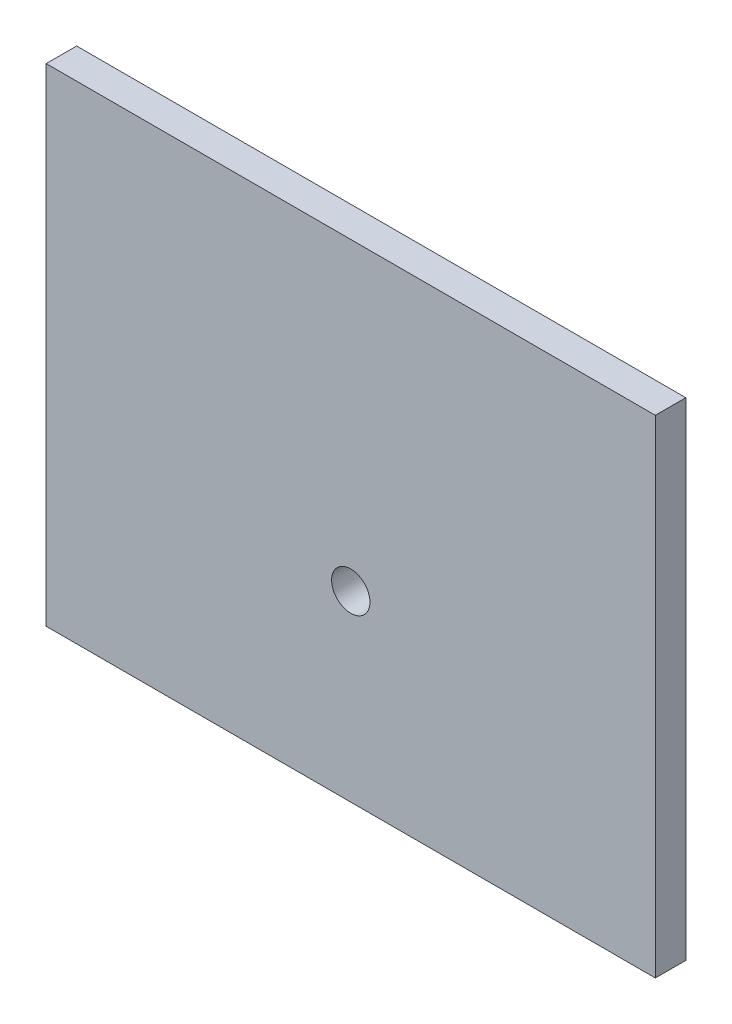
ISO-10303-21;
HEADER;
FILE_DESCRIPTION(('STEP AP214'),'2;1');
FILE_NAME('part.step','',(''),(''),'','','');
FILE_SCHEMA(('AUTOMOTIVE_DESIGN { 1 0 10303 214 1 1 1 1 }'));
ENDSEC;
DATA;
#1=APPLICATION_CONTEXT('core data for automotive mechanical design processes');
#2=APPLICATION_PROTOCOL_DEFINITION('international standard','automotive_design',2000,#1);
#3=PRODUCT_CONTEXT('',#1,'mechanical');
#4=PRODUCT('Part','Part','',(#3));
#5=PRODUCT_RELATED_PRODUCT_CATEGORY('part','',(#4));
#6=PRODUCT_DEFINITION_FORMATION('','',#4);
#7=PRODUCT_DEFINITION_CONTEXT('part definition',#1,'design');
#8=PRODUCT_DEFINITION('design','',#6,#7);
#9=PRODUCT_DEFINITION_SHAPE('','',#8);
#10=(LENGTH_UNIT() NAMED_UNIT(*) SI_UNIT(.MILLI.,.METRE.));
#11=(NAMED_UNIT(*) PLANE_ANGLE_UNIT() SI_UNIT($,.RADIAN.));
#12=(NAMED_UNIT(*) SI_UNIT($,.STERADIAN.) SOLID_ANGLE_UNIT());
#13=UNCERTAINTY_MEASURE_WITH_UNIT(LENGTH_MEASURE(1.E-05),#10,'distance_accuracy_value','');
#14=(GEOMETRIC_REPRESENTATION_CONTEXT(3) GLOBAL_UNCERTAINTY_ASSIGNED_CONTEXT((#13)) GLOBAL_UNIT_ASSIGNED_CONTEXT((#10,
#11,#12)) REPRESENTATION_CONTEXT('',''));
#15=CARTESIAN_POINT('',(0.,0.,0.));
#16=DIRECTION('',(0.,0.,1.));
#17=DIRECTION('',(1.,0.,0.));
#18=AXIS2_PLACEMENT_3D('',#15,#16,#17);
#19=CARTESIAN_POINT('',(0.,0.,6.35));
#20=DIRECTION('',(0.,0.,-1.));
#21=DIRECTION('',(-1.,0.,0.));
#22=AXIS2_PLACEMENT_3D('',#19,#20,#21);
#23=PLANE('',#22);
#24=DIRECTION('',(0.,-1.,0.));
#25=VECTOR('',#24,1.);
#26=CARTESIAN_POINT('',(0.,0.,6.35));
#27=LINE('',#26,#25);
#28=CARTESIAN_POINT('',(0.,101.6,6.35));
#29=VERTEX_POINT('',#28);
#30=CARTESIAN_POINT('',(0.,0.,6.35));
#31=VERTEX_POINT('',#30);
#32=EDGE_CURVE('E85',#29,#31,#27,.T.);
#33=ORIENTED_EDGE('',*,*,#32,.T.);
#34=DIRECTION('',(1.,0.,0.));
#35=VECTOR('',#34,1.);
#36=CARTESIAN_POINT('',(0.,0.,6.35));
#37=LINE('',#36,#35);
#38=CARTESIAN_POINT('',(127.,0.,6.35));
#39=VERTEX_POINT('',#38);
#40=EDGE_CURVE('E80',#31,#39,#37,.T.);
#41=ORIENTED_EDGE('',*,*,#40,.T.);
#42=DIRECTION('',(0.,1.,0.));
#43=VECTOR('',#42,1.);
#44=CARTESIAN_POINT('',(127.,0.,6.35));
#45=LINE('',#44,#43);
#46=CARTESIAN_POINT('',(127.,101.6,6.35));
#47=VERTEX_POINT('',#46);
#48=EDGE_CURVE('E83',#39,#47,#45,.T.);
#49=ORIENTED_EDGE('',*,*,#48,.T.);
#50=DIRECTION('',(-1.,0.,0.));
#51=VECTOR('',#50,1.);
#52=CARTESIAN_POINT('',(0.,101.6,6.35));
#53=LINE('',#52,#51);
#54=EDGE_CURVE('E50',#47,#29,#53,.T.);
#55=ORIENTED_EDGE('',*,*,#54,.T.);
#56=EDGE_LOOP('',(#33,#41,#49,#55));
#57=FACE_BOUND('',#56,.T.);
#58=CARTESIAN_POINT('',(63.5,38.1,6.35));
#59=DIRECTION('',(0.,0.,1.));
#60=DIRECTION('',(1.,0.,0.));
#61=AXIS2_PLACEMENT_3D('',#58,#59,#60);
#62=CIRCLE('',#61,4.00000000000002);
#63=CARTESIAN_POINT('',(67.5,38.1,6.35));
#64=VERTEX_POINT('',#63);
#65=EDGE_CURVE('E100',#64,#64,#62,.T.);
#66=ORIENTED_EDGE('',*,*,#65,.F.);
#67=EDGE_LOOP('',(#66));
#68=FACE_BOUND('',#67,.T.);
#69=ADVANCED_FACE('F33',(#57,#68),#23,.F.);
#70=CARTESIAN_POINT('',(0.,0.,0.));
#71=DIRECTION('',(0.,0.,-1.));
#72=DIRECTION('',(-1.,0.,0.));
#73=AXIS2_PLACEMENT_3D('',#70,#71,#72);
#74=PLANE('',#73);
#75=DIRECTION('',(0.,-1.,0.));
#76=VECTOR('',#75,1.);
#77=CARTESIAN_POINT('',(0.,0.,0.));
#78=LINE('',#77,#76);
#79=CARTESIAN_POINT('',(0.,101.6,0.));
#80=VERTEX_POINT('',#79);
#81=CARTESIAN_POINT('',(0.,0.,0.));
#82=VERTEX_POINT('',#81);
#83=EDGE_CURVE('E97',#80,#82,#78,.T.);
#84=ORIENTED_EDGE('',*,*,#83,.F.);
#85=DIRECTION('',(-1.,0.,0.));
#86=VECTOR('',#85,1.);
#87=CARTESIAN_POINT('',(0.,101.6,0.));
#88=LINE('',#87,#86);
#89=CARTESIAN_POINT('',(127.,101.6,0.));
#90=VERTEX_POINT('',#89);
#91=EDGE_CURVE('E73',#90,#80,#88,.T.);
#92=ORIENTED_EDGE('',*,*,#91,.F.);
#93=DIRECTION('',(0.,1.,0.));
#94=VECTOR('',#93,1.);
#95=CARTESIAN_POINT('',(127.,0.,0.));
#96=LINE('',#95,#94);
#97=CARTESIAN_POINT('',(127.,0.,0.));
#98=VERTEX_POINT('',#97);
#99=EDGE_CURVE('E67',#98,#90,#96,.T.);
#100=ORIENTED_EDGE('',*,*,#99,.F.);
#101=DIRECTION('',(1.,0.,0.));
#102=VECTOR('',#101,1.);
#103=CARTESIAN_POINT('',(0.,0.,0.));
#104=LINE('',#103,#102);
#105=EDGE_CURVE('E89',#82,#98,#104,.T.);
#106=ORIENTED_EDGE('',*,*,#105,.F.);
#107=EDGE_LOOP('',(#84,#92,#100,#106));
#108=FACE_BOUND('',#107,.T.);
#109=CARTESIAN_POINT('',(63.5,38.1,0.));
#110=DIRECTION('',(0.,0.,1.));
#111=DIRECTION('',(1.,0.,0.));
#112=AXIS2_PLACEMENT_3D('',#109,#110,#111);
#113=CIRCLE('',#112,4.00000000000002);
#114=CARTESIAN_POINT('',(67.5,38.1,0.));
#115=VERTEX_POINT('',#114);
#116=EDGE_CURVE('E112',#115,#115,#113,.T.);
#117=ORIENTED_EDGE('',*,*,#116,.T.);
#118=EDGE_LOOP('',(#117));
#119=FACE_BOUND('',#118,.T.);
#120=ADVANCED_FACE('F108',(#108,#119),#74,.T.);
#121=CARTESIAN_POINT('',(0.,0.,6.35));
#122=DIRECTION('',(1.,0.,0.));
#123=DIRECTION('',(0.,0.,-1.));
#124=AXIS2_PLACEMENT_3D('',#121,#122,#123);
#125=PLANE('',#124);
#126=ORIENTED_EDGE('',*,*,#83,.T.);
#127=DIRECTION('',(0.,0.,-1.));
#128=VECTOR('',#127,1.);
#129=CARTESIAN_POINT('',(0.,0.,6.35));
#130=LINE('',#129,#128);
#131=EDGE_CURVE('E11',#31,#82,#130,.T.);
#132=ORIENTED_EDGE('',*,*,#131,.F.);
#133=ORIENTED_EDGE('',*,*,#32,.F.);
#134=DIRECTION('',(0.,0.,-1.));
#135=VECTOR('',#134,1.);
#136=CARTESIAN_POINT('',(0.,101.6,6.35));
#137=LINE('',#136,#135);
#138=EDGE_CURVE('E93',#29,#80,#137,.T.);
#139=ORIENTED_EDGE('',*,*,#138,.T.);
#140=EDGE_LOOP('',(#126,#132,#133,#139));
#141=FACE_BOUND('',#140,.T.);
#142=ADVANCED_FACE('F35',(#141),#125,.F.);
#143=CARTESIAN_POINT('',(0.,0.,6.35));
#144=DIRECTION('',(0.,1.,0.));
#145=DIRECTION('',(0.,0.,1.));
#146=AXIS2_PLACEMENT_3D('',#143,#144,#145);
#147=PLANE('',#146);
#148=ORIENTED_EDGE('',*,*,#105,.T.);
#149=DIRECTION('',(0.,0.,-1.));
#150=VECTOR('',#149,1.);
#151=CARTESIAN_POINT('',(127.,0.,6.35));
#152=LINE('',#151,#150);
#153=EDGE_CURVE('E42',#39,#98,#152,.T.);
#154=ORIENTED_EDGE('',*,*,#153,.F.);
#155=ORIENTED_EDGE('',*,*,#40,.F.);
#156=ORIENTED_EDGE('',*,*,#131,.T.);
#157=EDGE_LOOP('',(#148,#154,#155,#156));
#158=FACE_BOUND('',#157,.T.);
#159=ADVANCED_FACE('F88',(#158),#147,.F.);
#160=CARTESIAN_POINT('',(127.,0.,6.35));
#161=DIRECTION('',(-1.,0.,0.));
#162=DIRECTION('',(0.,0.,1.));
#163=AXIS2_PLACEMENT_3D('',#160,#161,#162);
#164=PLANE('',#163);
#165=ORIENTED_EDGE('',*,*,#99,.T.);
#166=DIRECTION('',(0.,0.,-1.));
#167=VECTOR('',#166,1.);
#168=CARTESIAN_POINT('',(127.,101.6,6.35));
#169=LINE('',#168,#167);
#170=EDGE_CURVE('E90',#47,#90,#169,.T.);
#171=ORIENTED_EDGE('',*,*,#170,.F.);
#172=ORIENTED_EDGE('',*,*,#48,.F.);
#173=ORIENTED_EDGE('',*,*,#153,.T.);
#174=EDGE_LOOP('',(#165,#171,#172,#173));
#175=FACE_BOUND('',#174,.T.);
#176=ADVANCED_FACE('F91',(#175),#164,.F.);
#177=CARTESIAN_POINT('',(0.,101.6,6.35));
#178=DIRECTION('',(0.,-1.,0.));
#179=DIRECTION('',(0.,0.,-1.));
#180=AXIS2_PLACEMENT_3D('',#177,#178,#179);
#181=PLANE('',#180);
#182=ORIENTED_EDGE('',*,*,#91,.T.);
#183=ORIENTED_EDGE('',*,*,#138,.F.);
#184=ORIENTED_EDGE('',*,*,#54,.F.);
#185=ORIENTED_EDGE('',*,*,#170,.T.);
#186=EDGE_LOOP('',(#182,#183,#184,#185));
#187=FACE_BOUND('',#186,.T.);
#188=ADVANCED_FACE('F105',(#187),#181,.F.);
#189=CARTESIAN_POINT('',(63.5,38.1,6.35));
#190=DIRECTION('',(0.,0.,-1.));
#191=DIRECTION('',(-1.,0.,0.));
#192=AXIS2_PLACEMENT_3D('',#189,#190,#191);
#193=CYLINDRICAL_SURFACE('',#192,4.00000000000002);
#194=ORIENTED_EDGE('',*,*,#65,.T.);
#195=EDGE_LOOP('',(#194));
#196=FACE_BOUND('',#195,.T.);
#197=ORIENTED_EDGE('',*,*,#116,.F.);
#198=EDGE_LOOP('',(#197));
#199=FACE_BOUND('',#198,.T.);
#200=ADVANCED_FACE('F118',(#196,#199),#193,.F.);
#201=CLOSED_SHELL('',(#69,#120,#142,#159,#176,#188,#200));
#202=MANIFOLD_SOLID_BREP('B2',#201);
#203=ADVANCED_BREP_SHAPE_REPRESENTATION('',(#18,#202),#14);
#204=SHAPE_DEFINITION_REPRESENTATION(#9,#203);
ENDSEC;
END-ISO-10303-21;
